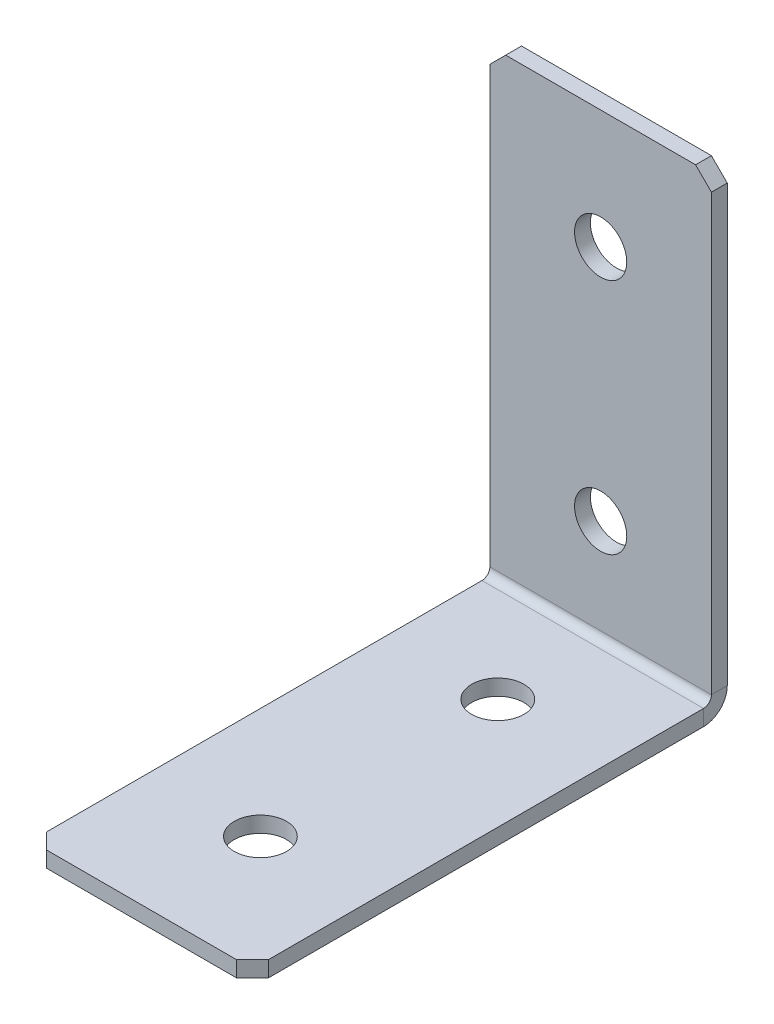
ISO-10303-21;
HEADER;
FILE_DESCRIPTION(('STEP AP214'),'2;1');
FILE_NAME('part.step','',(''),(''),'','','');
FILE_SCHEMA(('AUTOMOTIVE_DESIGN { 1 0 10303 214 1 1 1 1 }'));
ENDSEC;
DATA;
#1=APPLICATION_CONTEXT('core data for automotive mechanical design processes');
#2=APPLICATION_PROTOCOL_DEFINITION('international standard','automotive_design',2000,#1);
#3=PRODUCT_CONTEXT('',#1,'mechanical');
#4=PRODUCT('Part','Part','',(#3));
#5=PRODUCT_RELATED_PRODUCT_CATEGORY('part','',(#4));
#6=PRODUCT_DEFINITION_FORMATION('','',#4);
#7=PRODUCT_DEFINITION_CONTEXT('part definition',#1,'design');
#8=PRODUCT_DEFINITION('design','',#6,#7);
#9=PRODUCT_DEFINITION_SHAPE('','',#8);
#10=(LENGTH_UNIT() NAMED_UNIT(*) SI_UNIT(.MILLI.,.METRE.));
#11=(NAMED_UNIT(*) PLANE_ANGLE_UNIT() SI_UNIT($,.RADIAN.));
#12=(NAMED_UNIT(*) SI_UNIT($,.STERADIAN.) SOLID_ANGLE_UNIT());
#13=UNCERTAINTY_MEASURE_WITH_UNIT(LENGTH_MEASURE(1.E-05),#10,'distance_accuracy_value','');
#14=(GEOMETRIC_REPRESENTATION_CONTEXT(3) GLOBAL_UNCERTAINTY_ASSIGNED_CONTEXT((#13)) GLOBAL_UNIT_ASSIGNED_CONTEXT((#10,
#11,#12)) REPRESENTATION_CONTEXT('',''));
#15=CARTESIAN_POINT('',(0.,0.,0.));
#16=DIRECTION('',(0.,0.,1.));
#17=DIRECTION('',(1.,0.,0.));
#18=AXIS2_PLACEMENT_3D('',#15,#16,#17);
#19=CARTESIAN_POINT('',(0.,0.,2.));
#20=DIRECTION('',(0.,0.,-1.));
#21=DIRECTION('',(-1.,0.,0.));
#22=AXIS2_PLACEMENT_3D('',#19,#20,#21);
#23=PLANE('',#22);
#24=DIRECTION('',(0.,1.,0.));
#25=VECTOR('',#24,1.);
#26=CARTESIAN_POINT('',(14.,0.,2.));
#27=LINE('',#26,#25);
#28=CARTESIAN_POINT('',(14.,3.,2.));
#29=VERTEX_POINT('',#28);
#30=CARTESIAN_POINT('',(14.,58.,2.));
#31=VERTEX_POINT('',#30);
#32=EDGE_CURVE('E252',#29,#31,#27,.T.);
#33=ORIENTED_EDGE('',*,*,#32,.T.);
#34=DIRECTION('',(0.707106781186548,-0.707106781186548,0.));
#35=VECTOR('',#34,1.);
#36=CARTESIAN_POINT('',(14.,58.,2.));
#37=LINE('',#36,#35);
#38=CARTESIAN_POINT('',(12.,60.,2.));
#39=VERTEX_POINT('',#38);
#40=EDGE_CURVE('E301',#31,#39,#37,.F.);
#41=ORIENTED_EDGE('',*,*,#40,.T.);
#42=DIRECTION('',(-1.,0.,0.));
#43=VECTOR('',#42,1.);
#44=CARTESIAN_POINT('',(-14.,60.,2.));
#45=LINE('',#44,#43);
#46=CARTESIAN_POINT('',(-12.,60.,2.));
#47=VERTEX_POINT('',#46);
#48=EDGE_CURVE('E257',#39,#47,#45,.T.);
#49=ORIENTED_EDGE('',*,*,#48,.T.);
#50=DIRECTION('',(0.707106781186548,0.707106781186548,0.));
#51=VECTOR('',#50,1.);
#52=CARTESIAN_POINT('',(-12.,60.,2.));
#53=LINE('',#52,#51);
#54=CARTESIAN_POINT('',(-14.,58.,2.));
#55=VERTEX_POINT('',#54);
#56=EDGE_CURVE('E298',#47,#55,#53,.F.);
#57=ORIENTED_EDGE('',*,*,#56,.T.);
#58=DIRECTION('',(0.,-1.,0.));
#59=VECTOR('',#58,1.);
#60=CARTESIAN_POINT('',(-14.,0.,2.));
#61=LINE('',#60,#59);
#62=CARTESIAN_POINT('',(-14.,3.,2.));
#63=VERTEX_POINT('',#62);
#64=EDGE_CURVE('E249',#55,#63,#61,.T.);
#65=ORIENTED_EDGE('',*,*,#64,.T.);
#66=DIRECTION('',(1.,0.,0.));
#67=VECTOR('',#66,1.);
#68=CARTESIAN_POINT('',(14.,3.,2.));
#69=LINE('',#68,#67);
#70=EDGE_CURVE('E236',#29,#63,#69,.F.);
#71=ORIENTED_EDGE('',*,*,#70,.F.);
#72=EDGE_LOOP('',(#33,#41,#49,#57,#65,#71));
#73=FACE_BOUND('',#72,.T.);
#74=CARTESIAN_POINT('',(0.,45.,2.));
#75=DIRECTION('',(0.,0.,1.));
#76=DIRECTION('',(1.,0.,0.));
#77=AXIS2_PLACEMENT_3D('',#74,#75,#76);
#78=CIRCLE('',#77,3.3);
#79=CARTESIAN_POINT('',(3.3,45.,2.));
#80=VERTEX_POINT('',#79);
#81=EDGE_CURVE('E681',#80,#80,#78,.T.);
#82=ORIENTED_EDGE('',*,*,#81,.F.);
#83=EDGE_LOOP('',(#82));
#84=FACE_BOUND('',#83,.T.);
#85=CARTESIAN_POINT('',(0.,15.,2.));
#86=DIRECTION('',(0.,0.,1.));
#87=DIRECTION('',(1.,0.,0.));
#88=AXIS2_PLACEMENT_3D('',#85,#86,#87);
#89=CIRCLE('',#88,3.3);
#90=CARTESIAN_POINT('',(3.3,15.,2.));
#91=VERTEX_POINT('',#90);
#92=EDGE_CURVE('E664',#91,#91,#89,.T.);
#93=ORIENTED_EDGE('',*,*,#92,.F.);
#94=EDGE_LOOP('',(#93));
#95=FACE_BOUND('',#94,.T.);
#96=ADVANCED_FACE('F68',(#73,#84,#95),#23,.F.);
#97=CARTESIAN_POINT('',(14.,0.,2.));
#98=DIRECTION('',(-1.,0.,0.));
#99=DIRECTION('',(0.,1.,0.));
#100=AXIS2_PLACEMENT_3D('',#97,#98,#99);
#101=PLANE('',#100);
#102=DIRECTION('',(0.,1.,0.));
#103=VECTOR('',#102,1.);
#104=CARTESIAN_POINT('',(14.,0.,0.));
#105=LINE('',#104,#103);
#106=CARTESIAN_POINT('',(14.,3.,0.));
#107=VERTEX_POINT('',#106);
#108=CARTESIAN_POINT('',(14.,58.,0.));
#109=VERTEX_POINT('',#108);
#110=EDGE_CURVE('E264',#107,#109,#105,.T.);
#111=ORIENTED_EDGE('',*,*,#110,.T.);
#112=DIRECTION('',(0.,0.,-1.));
#113=VECTOR('',#112,1.);
#114=CARTESIAN_POINT('',(14.,58.,2.));
#115=LINE('',#114,#113);
#116=EDGE_CURVE('E294',#109,#31,#115,.F.);
#117=ORIENTED_EDGE('',*,*,#116,.T.);
#118=ORIENTED_EDGE('',*,*,#32,.F.);
#119=DIRECTION('',(0.,0.,-1.));
#120=VECTOR('',#119,1.);
#121=CARTESIAN_POINT('',(14.,3.,2.));
#122=LINE('',#121,#120);
#123=EDGE_CURVE('E231',#29,#107,#122,.T.);
#124=ORIENTED_EDGE('',*,*,#123,.T.);
#125=EDGE_LOOP('',(#111,#117,#118,#124));
#126=FACE_BOUND('',#125,.T.);
#127=ADVANCED_FACE('F322',(#126),#101,.F.);
#128=CARTESIAN_POINT('',(0.,0.,0.));
#129=DIRECTION('',(0.,0.,-1.));
#130=DIRECTION('',(-1.,0.,0.));
#131=AXIS2_PLACEMENT_3D('',#128,#129,#130);
#132=PLANE('',#131);
#133=CARTESIAN_POINT('',(0.,15.,0.));
#134=DIRECTION('',(0.,0.,-1.));
#135=DIRECTION('',(-1.,0.,0.));
#136=AXIS2_PLACEMENT_3D('',#133,#134,#135);
#137=CIRCLE('',#136,3.3);
#138=CARTESIAN_POINT('',(-3.3,15.,0.));
#139=VERTEX_POINT('',#138);
#140=EDGE_CURVE('E672',#139,#139,#137,.T.);
#141=ORIENTED_EDGE('',*,*,#140,.F.);
#142=EDGE_LOOP('',(#141));
#143=FACE_BOUND('',#142,.T.);
#144=CARTESIAN_POINT('',(0.,45.,0.));
#145=DIRECTION('',(0.,0.,-1.));
#146=DIRECTION('',(-1.,0.,0.));
#147=AXIS2_PLACEMENT_3D('',#144,#145,#146);
#148=CIRCLE('',#147,3.3);
#149=CARTESIAN_POINT('',(-3.3,45.,0.));
#150=VERTEX_POINT('',#149);
#151=EDGE_CURVE('E226',#150,#150,#148,.T.);
#152=ORIENTED_EDGE('',*,*,#151,.F.);
#153=EDGE_LOOP('',(#152));
#154=FACE_BOUND('',#153,.T.);
#155=DIRECTION('',(-1.,0.,0.));
#156=VECTOR('',#155,1.);
#157=CARTESIAN_POINT('',(0.,60.,0.));
#158=LINE('',#157,#156);
#159=CARTESIAN_POINT('',(12.,60.,0.));
#160=VERTEX_POINT('',#159);
#161=CARTESIAN_POINT('',(-12.,60.,0.));
#162=VERTEX_POINT('',#161);
#163=EDGE_CURVE('E253',#160,#162,#158,.T.);
#164=ORIENTED_EDGE('',*,*,#163,.F.);
#165=DIRECTION('',(-0.707106781186548,0.707106781186548,0.));
#166=VECTOR('',#165,1.);
#167=CARTESIAN_POINT('',(36.,36.,0.));
#168=LINE('',#167,#166);
#169=EDGE_CURVE('E78',#160,#109,#168,.F.);
#170=ORIENTED_EDGE('',*,*,#169,.T.);
#171=ORIENTED_EDGE('',*,*,#110,.F.);
#172=DIRECTION('',(1.,0.,0.));
#173=VECTOR('',#172,1.);
#174=CARTESIAN_POINT('',(14.,3.,0.));
#175=LINE('',#174,#173);
#176=CARTESIAN_POINT('',(-14.,3.00000000000001,0.));
#177=VERTEX_POINT('',#176);
#178=EDGE_CURVE('E167',#107,#177,#175,.F.);
#179=ORIENTED_EDGE('',*,*,#178,.T.);
#180=DIRECTION('',(0.,1.,0.));
#181=VECTOR('',#180,1.);
#182=CARTESIAN_POINT('',(-14.,0.,0.));
#183=LINE('',#182,#181);
#184=CARTESIAN_POINT('',(-14.,58.,0.));
#185=VERTEX_POINT('',#184);
#186=EDGE_CURVE('E246',#185,#177,#183,.F.);
#187=ORIENTED_EDGE('',*,*,#186,.F.);
#188=DIRECTION('',(-0.707106781186548,-0.707106781186548,0.));
#189=VECTOR('',#188,1.);
#190=CARTESIAN_POINT('',(-36.,36.,0.));
#191=LINE('',#190,#189);
#192=EDGE_CURVE('E90',#185,#162,#191,.F.);
#193=ORIENTED_EDGE('',*,*,#192,.T.);
#194=EDGE_LOOP('',(#164,#170,#171,#179,#187,#193));
#195=FACE_BOUND('',#194,.T.);
#196=ADVANCED_FACE('F317',(#143,#154,#195),#132,.T.);
#197=CARTESIAN_POINT('',(-14.,60.,2.));
#198=DIRECTION('',(0.,-1.,0.));
#199=DIRECTION('',(-1.,0.,0.));
#200=AXIS2_PLACEMENT_3D('',#197,#198,#199);
#201=PLANE('',#200);
#202=ORIENTED_EDGE('',*,*,#48,.F.);
#203=DIRECTION('',(0.,0.,1.));
#204=VECTOR('',#203,1.);
#205=CARTESIAN_POINT('',(12.,60.,2.));
#206=LINE('',#205,#204);
#207=EDGE_CURVE('E308',#39,#160,#206,.F.);
#208=ORIENTED_EDGE('',*,*,#207,.T.);
#209=ORIENTED_EDGE('',*,*,#163,.T.);
#210=DIRECTION('',(0.,0.,-1.));
#211=VECTOR('',#210,1.);
#212=CARTESIAN_POINT('',(-12.,60.,2.));
#213=LINE('',#212,#211);
#214=EDGE_CURVE('E304',#162,#47,#213,.F.);
#215=ORIENTED_EDGE('',*,*,#214,.T.);
#216=EDGE_LOOP('',(#202,#208,#209,#215));
#217=FACE_BOUND('',#216,.T.);
#218=ADVANCED_FACE('F330',(#217),#201,.F.);
#219=CARTESIAN_POINT('',(-14.,0.,2.));
#220=DIRECTION('',(1.,0.,0.));
#221=DIRECTION('',(0.,-1.,0.));
#222=AXIS2_PLACEMENT_3D('',#219,#220,#221);
#223=PLANE('',#222);
#224=ORIENTED_EDGE('',*,*,#64,.F.);
#225=DIRECTION('',(0.,0.,1.));
#226=VECTOR('',#225,1.);
#227=CARTESIAN_POINT('',(-14.,58.,2.));
#228=LINE('',#227,#226);
#229=EDGE_CURVE('E13',#55,#185,#228,.F.);
#230=ORIENTED_EDGE('',*,*,#229,.T.);
#231=ORIENTED_EDGE('',*,*,#186,.T.);
#232=DIRECTION('',(0.,0.,-1.));
#233=VECTOR('',#232,1.);
#234=CARTESIAN_POINT('',(-14.,3.,2.));
#235=LINE('',#234,#233);
#236=EDGE_CURVE('E242',#63,#177,#235,.T.);
#237=ORIENTED_EDGE('',*,*,#236,.F.);
#238=EDGE_LOOP('',(#224,#230,#231,#237));
#239=FACE_BOUND('',#238,.T.);
#240=ADVANCED_FACE('F334',(#239),#223,.F.);
#241=CARTESIAN_POINT('',(-14.,3.,3.));
#242=DIRECTION('',(-1.,0.,0.));
#243=DIRECTION('',(0.,0.,1.));
#244=AXIS2_PLACEMENT_3D('',#241,#242,#243);
#245=PLANE('',#244);
#246=DIRECTION('',(0.,1.,0.));
#247=VECTOR('',#246,1.);
#248=CARTESIAN_POINT('',(-14.,0.,2.99999999999999));
#249=LINE('',#248,#247);
#250=CARTESIAN_POINT('',(-14.,2.,3.));
#251=VERTEX_POINT('',#250);
#252=CARTESIAN_POINT('',(-14.,0.,2.99999999999999));
#253=VERTEX_POINT('',#252);
#254=EDGE_CURVE('E222',#251,#253,#249,.F.);
#255=ORIENTED_EDGE('',*,*,#254,.F.);
#256=CARTESIAN_POINT('',(-14.,3.,3.));
#257=DIRECTION('',(1.,0.,0.));
#258=DIRECTION('',(0.,0.,-1.));
#259=AXIS2_PLACEMENT_3D('',#256,#257,#258);
#260=CIRCLE('',#259,1.);
#261=EDGE_CURVE('E171',#63,#251,#260,.F.);
#262=ORIENTED_EDGE('',*,*,#261,.F.);
#263=ORIENTED_EDGE('',*,*,#236,.T.);
#264=CARTESIAN_POINT('',(-14.,3.,3.));
#265=DIRECTION('',(1.,0.,0.));
#266=DIRECTION('',(0.,0.,-1.));
#267=AXIS2_PLACEMENT_3D('',#264,#265,#266);
#268=CIRCLE('',#267,3.);
#269=EDGE_CURVE('E229',#177,#253,#268,.F.);
#270=ORIENTED_EDGE('',*,*,#269,.T.);
#271=EDGE_LOOP('',(#255,#262,#263,#270));
#272=FACE_BOUND('',#271,.T.);
#273=ADVANCED_FACE('F338',(#272),#245,.T.);
#274=CARTESIAN_POINT('',(14.,3.,3.));
#275=DIRECTION('',(-1.,0.,0.));
#276=DIRECTION('',(0.,0.,1.));
#277=AXIS2_PLACEMENT_3D('',#274,#275,#276);
#278=PLANE('',#277);
#279=CARTESIAN_POINT('',(14.,3.,3.));
#280=DIRECTION('',(1.,0.,0.));
#281=DIRECTION('',(0.,0.,-1.));
#282=AXIS2_PLACEMENT_3D('',#279,#280,#281);
#283=CIRCLE('',#282,1.);
#284=CARTESIAN_POINT('',(14.,2.,3.));
#285=VERTEX_POINT('',#284);
#286=EDGE_CURVE('E178',#285,#29,#283,.T.);
#287=ORIENTED_EDGE('',*,*,#286,.F.);
#288=DIRECTION('',(0.,1.,0.));
#289=VECTOR('',#288,1.);
#290=CARTESIAN_POINT('',(14.,2.,3.));
#291=LINE('',#290,#289);
#292=CARTESIAN_POINT('',(14.,0.,2.99999999999999));
#293=VERTEX_POINT('',#292);
#294=EDGE_CURVE('E175',#285,#293,#291,.F.);
#295=ORIENTED_EDGE('',*,*,#294,.T.);
#296=CARTESIAN_POINT('',(14.,3.,3.));
#297=DIRECTION('',(1.,0.,0.));
#298=DIRECTION('',(0.,0.,-1.));
#299=AXIS2_PLACEMENT_3D('',#296,#297,#298);
#300=CIRCLE('',#299,3.);
#301=EDGE_CURVE('E159',#293,#107,#300,.T.);
#302=ORIENTED_EDGE('',*,*,#301,.T.);
#303=ORIENTED_EDGE('',*,*,#123,.F.);
#304=EDGE_LOOP('',(#287,#295,#302,#303));
#305=FACE_BOUND('',#304,.T.);
#306=ADVANCED_FACE('F176',(#305),#278,.F.);
#307=CARTESIAN_POINT('',(14.,3.,3.));
#308=DIRECTION('',(1.,0.,0.));
#309=DIRECTION('',(0.,-1.,0.));
#310=AXIS2_PLACEMENT_3D('',#307,#308,#309);
#311=CYLINDRICAL_SURFACE('',#310,3.);
#312=ORIENTED_EDGE('',*,*,#178,.F.);
#313=ORIENTED_EDGE('',*,*,#301,.F.);
#314=DIRECTION('',(1.,0.,0.));
#315=VECTOR('',#314,1.);
#316=CARTESIAN_POINT('',(-14.,0.,2.99999999999999));
#317=LINE('',#316,#315);
#318=EDGE_CURVE('E164',#293,#253,#317,.F.);
#319=ORIENTED_EDGE('',*,*,#318,.T.);
#320=ORIENTED_EDGE('',*,*,#269,.F.);
#321=EDGE_LOOP('',(#312,#313,#319,#320));
#322=FACE_BOUND('',#321,.T.);
#323=ADVANCED_FACE('F161',(#322),#311,.T.);
#324=CARTESIAN_POINT('',(14.,3.,3.));
#325=DIRECTION('',(1.,0.,0.));
#326=DIRECTION('',(0.,-1.,0.));
#327=AXIS2_PLACEMENT_3D('',#324,#325,#326);
#328=CYLINDRICAL_SURFACE('',#327,1.);
#329=ORIENTED_EDGE('',*,*,#70,.T.);
#330=ORIENTED_EDGE('',*,*,#261,.T.);
#331=DIRECTION('',(1.,0.,0.));
#332=VECTOR('',#331,1.);
#333=CARTESIAN_POINT('',(-14.,2.,3.));
#334=LINE('',#333,#332);
#335=EDGE_CURVE('E184',#251,#285,#334,.T.);
#336=ORIENTED_EDGE('',*,*,#335,.T.);
#337=ORIENTED_EDGE('',*,*,#286,.T.);
#338=EDGE_LOOP('',(#329,#330,#336,#337));
#339=FACE_BOUND('',#338,.T.);
#340=ADVANCED_FACE('F341',(#339),#328,.F.);
#341=CARTESIAN_POINT('',(-14.,0.,1.99999999999999));
#342=DIRECTION('',(1.,0.,0.));
#343=DIRECTION('',(0.,0.,-1.));
#344=AXIS2_PLACEMENT_3D('',#341,#342,#343);
#345=PLANE('',#344);
#346=DIRECTION('',(0.,0.,-1.));
#347=VECTOR('',#346,1.);
#348=CARTESIAN_POINT('',(-14.,0.,0.));
#349=LINE('',#348,#347);
#350=CARTESIAN_POINT('',(-14.,-1.95567023748995E-13,58.));
#351=VERTEX_POINT('',#350);
#352=EDGE_CURVE('E192',#351,#253,#349,.T.);
#353=ORIENTED_EDGE('',*,*,#352,.F.);
#354=DIRECTION('',(0.,1.,0.));
#355=VECTOR('',#354,1.);
#356=CARTESIAN_POINT('',(-14.,-1.95522954975216E-13,58.));
#357=LINE('',#356,#355);
#358=CARTESIAN_POINT('',(-14.,1.9999999999998,58.));
#359=VERTEX_POINT('',#358);
#360=EDGE_CURVE('E290',#351,#359,#357,.T.);
#361=ORIENTED_EDGE('',*,*,#360,.T.);
#362=DIRECTION('',(0.,0.,1.));
#363=VECTOR('',#362,1.);
#364=CARTESIAN_POINT('',(-14.,2.,2.));
#365=LINE('',#364,#363);
#366=EDGE_CURVE('E194',#359,#251,#365,.F.);
#367=ORIENTED_EDGE('',*,*,#366,.T.);
#368=ORIENTED_EDGE('',*,*,#254,.T.);
#369=EDGE_LOOP('',(#353,#361,#367,#368));
#370=FACE_BOUND('',#369,.T.);
#371=ADVANCED_FACE('F358',(#370),#345,.F.);
#372=CARTESIAN_POINT('',(14.,-2.02528965820292E-13,60.));
#373=DIRECTION('',(-1.,0.,0.));
#374=DIRECTION('',(0.,0.,1.));
#375=AXIS2_PLACEMENT_3D('',#372,#373,#374);
#376=PLANE('',#375);
#377=DIRECTION('',(0.,0.,-1.));
#378=VECTOR('',#377,1.);
#379=CARTESIAN_POINT('',(14.,1.9999999999998,60.));
#380=LINE('',#379,#378);
#381=CARTESIAN_POINT('',(14.,1.9999999999998,58.));
#382=VERTEX_POINT('',#381);
#383=EDGE_CURVE('E215',#285,#382,#380,.F.);
#384=ORIENTED_EDGE('',*,*,#383,.T.);
#385=DIRECTION('',(0.,-1.,0.));
#386=VECTOR('',#385,1.);
#387=CARTESIAN_POINT('',(14.,-1.95546003142606E-13,58.));
#388=LINE('',#387,#386);
#389=CARTESIAN_POINT('',(14.,-1.95567023748995E-13,58.));
#390=VERTEX_POINT('',#389);
#391=EDGE_CURVE('E198',#382,#390,#388,.T.);
#392=ORIENTED_EDGE('',*,*,#391,.T.);
#393=DIRECTION('',(0.,0.,1.));
#394=VECTOR('',#393,1.);
#395=CARTESIAN_POINT('',(14.,0.,0.));
#396=LINE('',#395,#394);
#397=EDGE_CURVE('E189',#293,#390,#396,.T.);
#398=ORIENTED_EDGE('',*,*,#397,.F.);
#399=ORIENTED_EDGE('',*,*,#294,.F.);
#400=EDGE_LOOP('',(#384,#392,#398,#399));
#401=FACE_BOUND('',#400,.T.);
#402=ADVANCED_FACE('F196',(#401),#376,.F.);
#403=CARTESIAN_POINT('',(0.,0.,0.));
#404=DIRECTION('',(0.,1.,0.));
#405=DIRECTION('',(0.,0.,1.));
#406=AXIS2_PLACEMENT_3D('',#403,#404,#405);
#407=PLANE('',#406);
#408=CARTESIAN_POINT('',(0.,0.,15.));
#409=DIRECTION('',(0.,1.,0.));
#410=DIRECTION('',(0.,0.,1.));
#411=AXIS2_PLACEMENT_3D('',#408,#409,#410);
#412=CIRCLE('',#411,3.3);
#413=CARTESIAN_POINT('',(0.,0.,18.3));
#414=VERTEX_POINT('',#413);
#415=EDGE_CURVE('E659',#414,#414,#412,.T.);
#416=ORIENTED_EDGE('',*,*,#415,.T.);
#417=EDGE_LOOP('',(#416));
#418=FACE_BOUND('',#417,.T.);
#419=CARTESIAN_POINT('',(0.,-1.50053580671994E-13,45.));
#420=DIRECTION('',(0.,1.,0.));
#421=DIRECTION('',(0.,0.,1.));
#422=AXIS2_PLACEMENT_3D('',#419,#420,#421);
#423=CIRCLE('',#422,3.3);
#424=CARTESIAN_POINT('',(0.,-1.61575469090176E-13,48.3));
#425=VERTEX_POINT('',#424);
#426=EDGE_CURVE('E662',#425,#425,#423,.T.);
#427=ORIENTED_EDGE('',*,*,#426,.T.);
#428=EDGE_LOOP('',(#427));
#429=FACE_BOUND('',#428,.T.);
#430=ORIENTED_EDGE('',*,*,#397,.T.);
#431=DIRECTION('',(0.707106781186548,0.,-0.707106781186547));
#432=VECTOR('',#431,1.);
#433=CARTESIAN_POINT('',(12.,-2.02528965820292E-13,60.));
#434=LINE('',#433,#432);
#435=CARTESIAN_POINT('',(12.,-2.02549986426681E-13,60.));
#436=VERTEX_POINT('',#435);
#437=EDGE_CURVE('E287',#390,#436,#434,.F.);
#438=ORIENTED_EDGE('',*,*,#437,.T.);
#439=DIRECTION('',(-1.,0.,0.));
#440=VECTOR('',#439,1.);
#441=CARTESIAN_POINT('',(0.,-2.02549986426681E-13,60.));
#442=LINE('',#441,#440);
#443=CARTESIAN_POINT('',(-12.,-2.02549986426681E-13,60.));
#444=VERTEX_POINT('',#443);
#445=EDGE_CURVE('E200',#436,#444,#442,.T.);
#446=ORIENTED_EDGE('',*,*,#445,.T.);
#447=DIRECTION('',(0.707106781186548,0.,0.707106781186548));
#448=VECTOR('',#447,1.);
#449=CARTESIAN_POINT('',(-14.,-1.95522954975216E-13,58.));
#450=LINE('',#449,#448);
#451=EDGE_CURVE('E284',#444,#351,#450,.F.);
#452=ORIENTED_EDGE('',*,*,#451,.T.);
#453=ORIENTED_EDGE('',*,*,#352,.T.);
#454=ORIENTED_EDGE('',*,*,#318,.F.);
#455=EDGE_LOOP('',(#430,#438,#446,#452,#453,#454));
#456=FACE_BOUND('',#455,.T.);
#457=ADVANCED_FACE('F188',(#418,#429,#456),#407,.F.);
#458=CARTESIAN_POINT('',(0.,2.00000000000001,0.));
#459=DIRECTION('',(0.,1.,0.));
#460=DIRECTION('',(0.,0.,1.));
#461=AXIS2_PLACEMENT_3D('',#458,#459,#460);
#462=PLANE('',#461);
#463=CARTESIAN_POINT('',(0.,1.99999999999995,15.));
#464=DIRECTION('',(0.,1.,0.));
#465=DIRECTION('',(0.,0.,1.));
#466=AXIS2_PLACEMENT_3D('',#463,#464,#465);
#467=CIRCLE('',#466,3.3);
#468=CARTESIAN_POINT('',(0.,1.99999999999994,18.3));
#469=VERTEX_POINT('',#468);
#470=EDGE_CURVE('E704',#469,#469,#467,.T.);
#471=ORIENTED_EDGE('',*,*,#470,.F.);
#472=EDGE_LOOP('',(#471));
#473=FACE_BOUND('',#472,.T.);
#474=CARTESIAN_POINT('',(0.,1.99999999999985,45.));
#475=DIRECTION('',(0.,1.,0.));
#476=DIRECTION('',(0.,0.,1.));
#477=AXIS2_PLACEMENT_3D('',#474,#475,#476);
#478=CIRCLE('',#477,3.3);
#479=CARTESIAN_POINT('',(0.,1.99999999999984,48.3));
#480=VERTEX_POINT('',#479);
#481=EDGE_CURVE('E665',#480,#480,#478,.T.);
#482=ORIENTED_EDGE('',*,*,#481,.F.);
#483=EDGE_LOOP('',(#482));
#484=FACE_BOUND('',#483,.T.);
#485=DIRECTION('',(1.,0.,0.));
#486=VECTOR('',#485,1.);
#487=CARTESIAN_POINT('',(-14.,1.9999999999998,60.));
#488=LINE('',#487,#486);
#489=CARTESIAN_POINT('',(12.,1.9999999999998,60.));
#490=VERTEX_POINT('',#489);
#491=CARTESIAN_POINT('',(-12.,1.9999999999998,60.));
#492=VERTEX_POINT('',#491);
#493=EDGE_CURVE('E208',#490,#492,#488,.F.);
#494=ORIENTED_EDGE('',*,*,#493,.F.);
#495=DIRECTION('',(-0.707106781186548,0.,0.707106781186547));
#496=VECTOR('',#495,1.);
#497=CARTESIAN_POINT('',(36.,1.99999999999988,36.));
#498=LINE('',#497,#496);
#499=EDGE_CURVE('E279',#490,#382,#498,.F.);
#500=ORIENTED_EDGE('',*,*,#499,.T.);
#501=ORIENTED_EDGE('',*,*,#383,.F.);
#502=ORIENTED_EDGE('',*,*,#335,.F.);
#503=ORIENTED_EDGE('',*,*,#366,.F.);
#504=DIRECTION('',(-0.707106781186548,0.,-0.707106781186548));
#505=VECTOR('',#504,1.);
#506=CARTESIAN_POINT('',(-36.,1.99999999999988,36.));
#507=LINE('',#506,#505);
#508=EDGE_CURVE('E276',#359,#492,#507,.F.);
#509=ORIENTED_EDGE('',*,*,#508,.T.);
#510=EDGE_LOOP('',(#494,#500,#501,#502,#503,#509));
#511=FACE_BOUND('',#510,.T.);
#512=ADVANCED_FACE('F345',(#473,#484,#511),#462,.T.);
#513=CARTESIAN_POINT('',(-14.,-2.02528965820292E-13,60.));
#514=DIRECTION('',(0.,0.,-1.));
#515=DIRECTION('',(0.,1.,0.));
#516=AXIS2_PLACEMENT_3D('',#513,#514,#515);
#517=PLANE('',#516);
#518=ORIENTED_EDGE('',*,*,#445,.F.);
#519=DIRECTION('',(0.,1.,0.));
#520=VECTOR('',#519,1.);
#521=CARTESIAN_POINT('',(12.,-2.02528965820292E-13,60.));
#522=LINE('',#521,#520);
#523=EDGE_CURVE('E272',#436,#490,#522,.T.);
#524=ORIENTED_EDGE('',*,*,#523,.T.);
#525=ORIENTED_EDGE('',*,*,#493,.T.);
#526=DIRECTION('',(0.,-1.,0.));
#527=VECTOR('',#526,1.);
#528=CARTESIAN_POINT('',(-12.,-2.02528965820292E-13,60.));
#529=LINE('',#528,#527);
#530=EDGE_CURVE('E261',#492,#444,#529,.T.);
#531=ORIENTED_EDGE('',*,*,#530,.T.);
#532=EDGE_LOOP('',(#518,#524,#525,#531));
#533=FACE_BOUND('',#532,.T.);
#534=ADVANCED_FACE('F352',(#533),#517,.F.);
#535=CARTESIAN_POINT('',(0.,45.,2.));
#536=DIRECTION('',(0.,0.,1.));
#537=DIRECTION('',(1.,0.,0.));
#538=AXIS2_PLACEMENT_3D('',#535,#536,#537);
#539=CYLINDRICAL_SURFACE('',#538,3.3);
#540=ORIENTED_EDGE('',*,*,#81,.T.);
#541=EDGE_LOOP('',(#540));
#542=FACE_BOUND('',#541,.T.);
#543=ORIENTED_EDGE('',*,*,#151,.T.);
#544=EDGE_LOOP('',(#543));
#545=FACE_BOUND('',#544,.T.);
#546=ADVANCED_FACE('F442',(#542,#545),#539,.F.);
#547=CARTESIAN_POINT('',(0.,15.,2.));
#548=DIRECTION('',(0.,0.,1.));
#549=DIRECTION('',(1.,0.,0.));
#550=AXIS2_PLACEMENT_3D('',#547,#548,#549);
#551=CYLINDRICAL_SURFACE('',#550,3.3);
#552=ORIENTED_EDGE('',*,*,#92,.T.);
#553=EDGE_LOOP('',(#552));
#554=FACE_BOUND('',#553,.T.);
#555=ORIENTED_EDGE('',*,*,#140,.T.);
#556=EDGE_LOOP('',(#555));
#557=FACE_BOUND('',#556,.T.);
#558=ADVANCED_FACE('F433',(#554,#557),#551,.F.);
#559=CARTESIAN_POINT('',(0.,1.99999999999985,45.));
#560=DIRECTION('',(0.,1.,0.));
#561=DIRECTION('',(0.,0.,1.));
#562=AXIS2_PLACEMENT_3D('',#559,#560,#561);
#563=CYLINDRICAL_SURFACE('',#562,3.3);
#564=ORIENTED_EDGE('',*,*,#426,.F.);
#565=EDGE_LOOP('',(#564));
#566=FACE_BOUND('',#565,.T.);
#567=ORIENTED_EDGE('',*,*,#481,.T.);
#568=EDGE_LOOP('',(#567));
#569=FACE_BOUND('',#568,.T.);
#570=ADVANCED_FACE('F424',(#566,#569),#563,.F.);
#571=CARTESIAN_POINT('',(0.,1.99999999999995,15.));
#572=DIRECTION('',(0.,1.,0.));
#573=DIRECTION('',(0.,0.,1.));
#574=AXIS2_PLACEMENT_3D('',#571,#572,#573);
#575=CYLINDRICAL_SURFACE('',#574,3.3);
#576=ORIENTED_EDGE('',*,*,#415,.F.);
#577=EDGE_LOOP('',(#576));
#578=FACE_BOUND('',#577,.T.);
#579=ORIENTED_EDGE('',*,*,#470,.T.);
#580=EDGE_LOOP('',(#579));
#581=FACE_BOUND('',#580,.T.);
#582=ADVANCED_FACE('F390',(#578,#581),#575,.F.);
#583=CARTESIAN_POINT('',(12.,-2.02528965820292E-13,60.));
#584=DIRECTION('',(-0.707106781186547,0.,-0.707106781186548));
#585=DIRECTION('',(0.,1.,0.));
#586=AXIS2_PLACEMENT_3D('',#583,#584,#585);
#587=PLANE('',#586);
#588=ORIENTED_EDGE('',*,*,#437,.F.);
#589=ORIENTED_EDGE('',*,*,#391,.F.);
#590=ORIENTED_EDGE('',*,*,#499,.F.);
#591=ORIENTED_EDGE('',*,*,#523,.F.);
#592=EDGE_LOOP('',(#588,#589,#590,#591));
#593=FACE_BOUND('',#592,.T.);
#594=ADVANCED_FACE('F347',(#593),#587,.F.);
#595=CARTESIAN_POINT('',(-14.,-1.95522954975216E-13,58.));
#596=DIRECTION('',(0.707106781186547,0.,-0.707106781186547));
#597=DIRECTION('',(0.,1.,0.));
#598=AXIS2_PLACEMENT_3D('',#595,#596,#597);
#599=PLANE('',#598);
#600=ORIENTED_EDGE('',*,*,#451,.F.);
#601=ORIENTED_EDGE('',*,*,#530,.F.);
#602=ORIENTED_EDGE('',*,*,#508,.F.);
#603=ORIENTED_EDGE('',*,*,#360,.F.);
#604=EDGE_LOOP('',(#600,#601,#602,#603));
#605=FACE_BOUND('',#604,.T.);
#606=ADVANCED_FACE('F355',(#605),#599,.F.);
#607=CARTESIAN_POINT('',(14.,58.,2.));
#608=DIRECTION('',(-0.707106781186547,-0.707106781186547,0.));
#609=DIRECTION('',(0.,0.,1.));
#610=AXIS2_PLACEMENT_3D('',#607,#608,#609);
#611=PLANE('',#610);
#612=ORIENTED_EDGE('',*,*,#169,.F.);
#613=ORIENTED_EDGE('',*,*,#207,.F.);
#614=ORIENTED_EDGE('',*,*,#40,.F.);
#615=ORIENTED_EDGE('',*,*,#116,.F.);
#616=EDGE_LOOP('',(#612,#613,#614,#615));
#617=FACE_BOUND('',#616,.T.);
#618=ADVANCED_FACE('F324',(#617),#611,.F.);
#619=CARTESIAN_POINT('',(-12.,60.,2.));
#620=DIRECTION('',(0.707106781186547,-0.707106781186547,0.));
#621=DIRECTION('',(0.,0.,1.));
#622=AXIS2_PLACEMENT_3D('',#619,#620,#621);
#623=PLANE('',#622);
#624=ORIENTED_EDGE('',*,*,#192,.F.);
#625=ORIENTED_EDGE('',*,*,#229,.F.);
#626=ORIENTED_EDGE('',*,*,#56,.F.);
#627=ORIENTED_EDGE('',*,*,#214,.F.);
#628=EDGE_LOOP('',(#624,#625,#626,#627));
#629=FACE_BOUND('',#628,.T.);
#630=ADVANCED_FACE('F71',(#629),#623,.F.);
#631=CLOSED_SHELL('',(#96,#127,#196,#218,#240,#273,#306,#323,#340,#371,#402,#457,#512,#534,#546,
#558,#570,#582,#594,#606,#618,#630));
#632=MANIFOLD_SOLID_BREP('B2',#631);
#633=ADVANCED_BREP_SHAPE_REPRESENTATION('',(#18,#632),#14);
#634=SHAPE_DEFINITION_REPRESENTATION(#9,#633);
ENDSEC;
END-ISO-10303-21;
